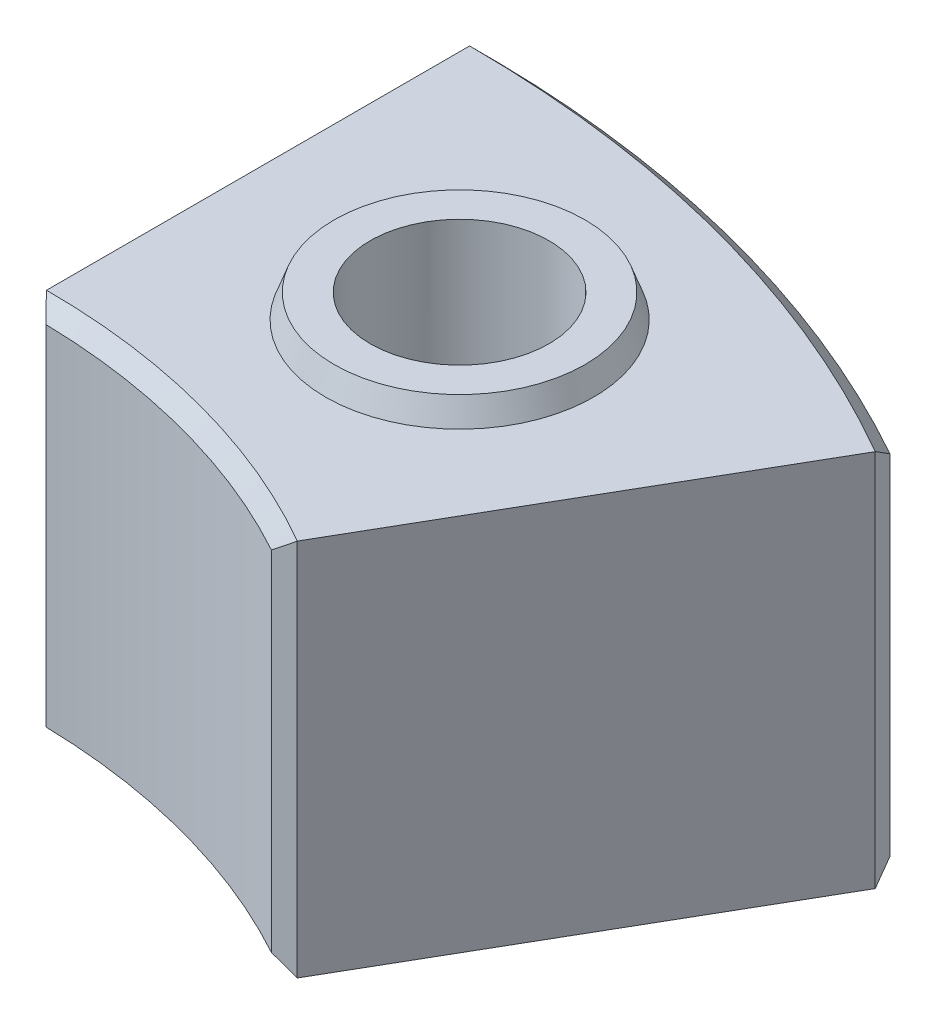
ISO-10303-21;
HEADER;
FILE_DESCRIPTION(('STEP AP214'),'2;1');
FILE_NAME('part.step','',(''),(''),'','','');
FILE_SCHEMA(('AUTOMOTIVE_DESIGN { 1 0 10303 214 1 1 1 1 }'));
ENDSEC;
DATA;
#1=APPLICATION_CONTEXT('core data for automotive mechanical design processes');
#2=APPLICATION_PROTOCOL_DEFINITION('international standard','automotive_design',2000,#1);
#3=PRODUCT_CONTEXT('',#1,'mechanical');
#4=PRODUCT('Part','Part','',(#3));
#5=PRODUCT_RELATED_PRODUCT_CATEGORY('part','',(#4));
#6=PRODUCT_DEFINITION_FORMATION('','',#4);
#7=PRODUCT_DEFINITION_CONTEXT('part definition',#1,'design');
#8=PRODUCT_DEFINITION('design','',#6,#7);
#9=PRODUCT_DEFINITION_SHAPE('','',#8);
#10=(LENGTH_UNIT() NAMED_UNIT(*) SI_UNIT(.MILLI.,.METRE.));
#11=(NAMED_UNIT(*) PLANE_ANGLE_UNIT() SI_UNIT($,.RADIAN.));
#12=(NAMED_UNIT(*) SI_UNIT($,.STERADIAN.) SOLID_ANGLE_UNIT());
#13=UNCERTAINTY_MEASURE_WITH_UNIT(LENGTH_MEASURE(1.E-05),#10,'distance_accuracy_value','');
#14=(GEOMETRIC_REPRESENTATION_CONTEXT(3) GLOBAL_UNCERTAINTY_ASSIGNED_CONTEXT((#13)) GLOBAL_UNIT_ASSIGNED_CONTEXT((#10,
#11,#12)) REPRESENTATION_CONTEXT('',''));
#15=CARTESIAN_POINT('',(0.,0.,0.));
#16=DIRECTION('',(0.,0.,1.));
#17=DIRECTION('',(1.,0.,0.));
#18=AXIS2_PLACEMENT_3D('',#15,#16,#17);
#19=CARTESIAN_POINT('',(77.904532575859,-127.,-290.74367371301));
#20=DIRECTION('',(0.,1.,0.));
#21=DIRECTION('',(0.,0.,1.));
#22=AXIS2_PLACEMENT_3D('',#19,#20,#21);
#23=CYLINDRICAL_SURFACE('',#22,30.);
#24=CARTESIAN_POINT('',(77.904532575859,8.,-290.74367371301));
#25=DIRECTION('',(0.,1.,0.));
#26=DIRECTION('',(0.,0.,1.));
#27=AXIS2_PLACEMENT_3D('',#24,#25,#26);
#28=CIRCLE('',#27,30.);
#29=CARTESIAN_POINT('',(77.904532575859,8.,-260.74367371301));
#30=VERTEX_POINT('',#29);
#31=EDGE_CURVE('E373',#30,#30,#28,.T.);
#32=ORIENTED_EDGE('',*,*,#31,.T.);
#33=EDGE_LOOP('',(#32));
#34=FACE_BOUND('',#33,.T.);
#35=CARTESIAN_POINT('',(77.904532575859,-117.,-290.74367371301));
#36=DIRECTION('',(0.,-1.,0.));
#37=DIRECTION('',(0.,0.,-1.));
#38=AXIS2_PLACEMENT_3D('',#35,#36,#37);
#39=CIRCLE('',#38,30.);
#40=CARTESIAN_POINT('',(77.904532575859,-117.,-320.74367371301));
#41=VERTEX_POINT('',#40);
#42=EDGE_CURVE('E239',#41,#41,#39,.T.);
#43=ORIENTED_EDGE('',*,*,#42,.T.);
#44=EDGE_LOOP('',(#43));
#45=FACE_BOUND('',#44,.T.);
#46=ADVANCED_FACE('F35',(#34,#45),#23,.F.);
#47=CARTESIAN_POINT('',(0.,0.,0.));
#48=DIRECTION('',(0.,1.,0.));
#49=DIRECTION('',(0.,0.,1.));
#50=AXIS2_PLACEMENT_3D('',#47,#48,#49);
#51=PLANE('',#50);
#52=DIRECTION('',(0.,0.,1.));
#53=VECTOR('',#52,1.);
#54=CARTESIAN_POINT('',(0.,0.,-225.));
#55=LINE('',#54,#53);
#56=CARTESIAN_POINT('',(0.,0.,-371.966396331712));
#57=VERTEX_POINT('',#56);
#58=CARTESIAN_POINT('',(0.,0.,-230.));
#59=VERTEX_POINT('',#58);
#60=EDGE_CURVE('E361',#57,#59,#55,.T.);
#61=ORIENTED_EDGE('',*,*,#60,.T.);
#62=CARTESIAN_POINT('',(0.,0.,0.));
#63=DIRECTION('',(0.,1.,0.));
#64=DIRECTION('',(0.,0.,1.));
#65=AXIS2_PLACEMENT_3D('',#62,#63,#64);
#66=CIRCLE('',#65,230.);
#67=CARTESIAN_POINT('',(115.,0.,-199.185842870421));
#68=VERTEX_POINT('',#67);
#69=EDGE_CURVE('E191',#59,#68,#66,.F.);
#70=ORIENTED_EDGE('',*,*,#69,.T.);
#71=DIRECTION('',(0.500000000000001,0.,-0.866025403784438));
#72=VECTOR('',#71,1.);
#73=CARTESIAN_POINT('',(112.5,0.,-194.855715851499));
#74=LINE('',#73,#72);
#75=CARTESIAN_POINT('',(185.983198165856,0.,-322.132348577413));
#76=VERTEX_POINT('',#75);
#77=EDGE_CURVE('E355',#68,#76,#74,.T.);
#78=ORIENTED_EDGE('',*,*,#77,.T.);
#79=DIRECTION('',(0.265304783703887,0.,0.964164597848227));
#80=VECTOR('',#79,1.);
#81=CARTESIAN_POINT('',(255.293110955295,0.,-70.2478432979643));
#82=LINE('',#81,#80);
#83=CARTESIAN_POINT('',(185.97050514315,0.,-322.178477271219));
#84=VERTEX_POINT('',#83);
#85=EDGE_CURVE('E187',#76,#84,#82,.F.);
#86=ORIENTED_EDGE('',*,*,#85,.T.);
#87=CARTESIAN_POINT('',(0.,0.,0.));
#88=DIRECTION('',(0.,1.,0.));
#89=DIRECTION('',(0.,0.,1.));
#90=AXIS2_PLACEMENT_3D('',#87,#88,#89);
#91=CIRCLE('',#90,372.);
#92=CARTESIAN_POINT('',(0.0340568270174031,0.,-371.999998441038));
#93=VERTEX_POINT('',#92);
#94=EDGE_CURVE('E185',#84,#93,#91,.T.);
#95=ORIENTED_EDGE('',*,*,#94,.T.);
#96=DIRECTION('',(0.711842981357215,0.,-0.702338643314229));
#97=VECTOR('',#96,1.);
#98=CARTESIAN_POINT('',(-185.966397849462,0.,-188.482972334752));
#99=LINE('',#98,#97);
#100=EDGE_CURVE('E189',#93,#57,#99,.F.);
#101=ORIENTED_EDGE('',*,*,#100,.T.);
#102=EDGE_LOOP('',(#61,#70,#78,#86,#95,#101));
#103=FACE_BOUND('',#102,.T.);
#104=CARTESIAN_POINT('',(77.904532575859,0.,-290.74367371301));
#105=DIRECTION('',(0.,1.,0.));
#106=DIRECTION('',(0.,0.,1.));
#107=AXIS2_PLACEMENT_3D('',#104,#105,#106);
#108=CIRCLE('',#107,45.);
#109=CARTESIAN_POINT('',(77.904532575859,0.,-245.74367371301));
#110=VERTEX_POINT('',#109);
#111=EDGE_CURVE('E366',#110,#110,#108,.T.);
#112=ORIENTED_EDGE('',*,*,#111,.F.);
#113=EDGE_LOOP('',(#112));
#114=FACE_BOUND('',#113,.T.);
#115=ADVANCED_FACE('F283',(#103,#114),#51,.T.);
#116=CARTESIAN_POINT('',(0.,-127.,0.));
#117=DIRECTION('',(0.,1.,0.));
#118=DIRECTION('',(0.,0.,1.));
#119=AXIS2_PLACEMENT_3D('',#116,#117,#118);
#120=CYLINDRICAL_SURFACE('',#119,225.);
#121=CARTESIAN_POINT('',(0.,-122.,0.));
#122=DIRECTION('',(0.,1.,0.));
#123=DIRECTION('',(0.,0.,1.));
#124=AXIS2_PLACEMENT_3D('',#121,#122,#123);
#125=CIRCLE('',#124,225.);
#126=CARTESIAN_POINT('',(4.89130434782612,-122.,-224.94682736544));
#127=VERTEX_POINT('',#126);
#128=CARTESIAN_POINT('',(108.237419859861,-122.,-197.255319173096));
#129=VERTEX_POINT('',#128);
#130=EDGE_CURVE('E155',#127,#129,#125,.F.);
#131=ORIENTED_EDGE('',*,*,#130,.T.);
#132=DIRECTION('',(0.,1.,0.));
#133=VECTOR('',#132,1.);
#134=CARTESIAN_POINT('',(108.237419859861,-127.,-197.255319173096));
#135=LINE('',#134,#133);
#136=CARTESIAN_POINT('',(108.237419859861,-5.00000000000003,-197.255319173096));
#137=VERTEX_POINT('',#136);
#138=EDGE_CURVE('E135',#129,#137,#135,.T.);
#139=ORIENTED_EDGE('',*,*,#138,.T.);
#140=CARTESIAN_POINT('',(0.,-5.00000000000003,0.));
#141=DIRECTION('',(0.,1.,0.));
#142=DIRECTION('',(0.,0.,1.));
#143=AXIS2_PLACEMENT_3D('',#140,#141,#142);
#144=CIRCLE('',#143,225.);
#145=CARTESIAN_POINT('',(4.89130434782612,-5.00000000000003,-224.94682736544));
#146=VERTEX_POINT('',#145);
#147=EDGE_CURVE('E143',#137,#146,#144,.T.);
#148=ORIENTED_EDGE('',*,*,#147,.T.);
#149=DIRECTION('',(0.,1.,0.));
#150=VECTOR('',#149,1.);
#151=CARTESIAN_POINT('',(4.89130434782612,-127.,-224.94682736544));
#152=LINE('',#151,#150);
#153=EDGE_CURVE('E150',#146,#127,#152,.F.);
#154=ORIENTED_EDGE('',*,*,#153,.T.);
#155=EDGE_LOOP('',(#131,#139,#148,#154));
#156=FACE_BOUND('',#155,.T.);
#157=ADVANCED_FACE('F153',(#156),#120,.F.);
#158=CARTESIAN_POINT('',(0.,-127.,-225.));
#159=DIRECTION('',(-1.,0.,0.));
#160=DIRECTION('',(0.,0.,1.));
#161=AXIS2_PLACEMENT_3D('',#158,#159,#160);
#162=PLANE('',#161);
#163=DIRECTION('',(0.,0.,1.));
#164=VECTOR('',#163,1.);
#165=CARTESIAN_POINT('',(0.,-127.,-225.));
#166=LINE('',#165,#164);
#167=CARTESIAN_POINT('',(0.,-127.,-371.966396331712));
#168=VERTEX_POINT('',#167);
#169=CARTESIAN_POINT('',(0.,-127.,-230.));
#170=VERTEX_POINT('',#169);
#171=EDGE_CURVE('E343',#168,#170,#166,.T.);
#172=ORIENTED_EDGE('',*,*,#171,.T.);
#173=DIRECTION('',(0.,-0.707106781186549,-0.707106781186546));
#174=VECTOR('',#173,1.);
#175=CARTESIAN_POINT('',(0.,103.000000000001,0.));
#176=LINE('',#175,#174);
#177=CARTESIAN_POINT('',(0.,-126.945645751338,-229.945645751338));
#178=VERTEX_POINT('',#177);
#179=EDGE_CURVE('E183',#170,#178,#176,.F.);
#180=ORIENTED_EDGE('',*,*,#179,.T.);
#181=DIRECTION('',(0.,1.,0.));
#182=VECTOR('',#181,1.);
#183=CARTESIAN_POINT('',(0.,-127.,-229.945645751338));
#184=LINE('',#183,#182);
#185=CARTESIAN_POINT('',(0.,-0.0543542486616255,-229.945645751338));
#186=VERTEX_POINT('',#185);
#187=EDGE_CURVE('E181',#178,#186,#184,.T.);
#188=ORIENTED_EDGE('',*,*,#187,.T.);
#189=DIRECTION('',(0.,-0.707106781186549,0.707106781186546));
#190=VECTOR('',#189,1.);
#191=CARTESIAN_POINT('',(0.,-230.000000000001,0.));
#192=LINE('',#191,#190);
#193=EDGE_CURVE('E179',#186,#59,#192,.F.);
#194=ORIENTED_EDGE('',*,*,#193,.T.);
#195=ORIENTED_EDGE('',*,*,#60,.F.);
#196=DIRECTION('',(0.,-1.,0.));
#197=VECTOR('',#196,1.);
#198=CARTESIAN_POINT('',(0.,-127.,-371.966396331712));
#199=LINE('',#198,#197);
#200=EDGE_CURVE('E176',#57,#168,#199,.T.);
#201=ORIENTED_EDGE('',*,*,#200,.T.);
#202=EDGE_LOOP('',(#172,#180,#188,#194,#195,#201));
#203=FACE_BOUND('',#202,.T.);
#204=ADVANCED_FACE('F303',(#203),#162,.T.);
#205=CARTESIAN_POINT('',(0.,-127.,0.));
#206=DIRECTION('',(0.,1.,0.));
#207=DIRECTION('',(0.,0.,1.));
#208=AXIS2_PLACEMENT_3D('',#205,#206,#207);
#209=CYLINDRICAL_SURFACE('',#208,377.);
#210=CARTESIAN_POINT('',(0.,-122.,0.));
#211=DIRECTION('',(0.,1.,0.));
#212=DIRECTION('',(0.,0.,1.));
#213=AXIS2_PLACEMENT_3D('',#210,#211,#212);
#214=CIRCLE('',#213,377.);
#215=CARTESIAN_POINT('',(184.094644683855,-122.,-328.995686595927));
#216=VERTEX_POINT('',#215);
#217=CARTESIAN_POINT('',(5.06720430107527,-122.,-376.965944669504));
#218=VERTEX_POINT('',#217);
#219=EDGE_CURVE('E50',#216,#218,#214,.T.);
#220=ORIENTED_EDGE('',*,*,#219,.T.);
#221=DIRECTION('',(0.,1.,0.));
#222=VECTOR('',#221,1.);
#223=CARTESIAN_POINT('',(5.06720430107527,-127.,-376.965944669504));
#224=LINE('',#223,#222);
#225=CARTESIAN_POINT('',(5.06720430107527,-5.,-376.965944669504));
#226=VERTEX_POINT('',#225);
#227=EDGE_CURVE('E11',#218,#226,#224,.T.);
#228=ORIENTED_EDGE('',*,*,#227,.T.);
#229=CARTESIAN_POINT('',(0.,-5.,0.));
#230=DIRECTION('',(0.,1.,0.));
#231=DIRECTION('',(0.,0.,1.));
#232=AXIS2_PLACEMENT_3D('',#229,#230,#231);
#233=CIRCLE('',#232,377.);
#234=CARTESIAN_POINT('',(184.094644683855,-5.,-328.995686595927));
#235=VERTEX_POINT('',#234);
#236=EDGE_CURVE('E193',#226,#235,#233,.F.);
#237=ORIENTED_EDGE('',*,*,#236,.T.);
#238=DIRECTION('',(0.,1.,0.));
#239=VECTOR('',#238,1.);
#240=CARTESIAN_POINT('',(184.094644683855,-127.,-328.995686595927));
#241=LINE('',#240,#239);
#242=EDGE_CURVE('E61',#235,#216,#241,.F.);
#243=ORIENTED_EDGE('',*,*,#242,.T.);
#244=EDGE_LOOP('',(#220,#228,#237,#243));
#245=FACE_BOUND('',#244,.T.);
#246=ADVANCED_FACE('F306',(#245),#209,.T.);
#247=CARTESIAN_POINT('',(112.5,-127.,-194.855715851499));
#248=DIRECTION('',(0.866025403784438,0.,0.500000000000001));
#249=DIRECTION('',(0.500000000000001,0.,-0.866025403784438));
#250=AXIS2_PLACEMENT_3D('',#247,#248,#249);
#251=PLANE('',#250);
#252=DIRECTION('',(0.,-1.,0.));
#253=VECTOR('',#252,1.);
#254=CARTESIAN_POINT('',(114.972822875669,-127.,-199.138770710276));
#255=LINE('',#254,#253);
#256=CARTESIAN_POINT('',(114.972822875669,-0.0543542486616255,-199.138770710276));
#257=VERTEX_POINT('',#256);
#258=CARTESIAN_POINT('',(114.972822875669,-126.945645751338,-199.138770710276));
#259=VERTEX_POINT('',#258);
#260=EDGE_CURVE('E137',#257,#259,#255,.T.);
#261=ORIENTED_EDGE('',*,*,#260,.T.);
#262=DIRECTION('',(-0.353553390593274,0.70710678118655,0.612372435695792));
#263=VECTOR('',#262,1.);
#264=CARTESIAN_POINT('',(0.,103.000000000001,0.));
#265=LINE('',#264,#263);
#266=CARTESIAN_POINT('',(115.,-127.,-199.185842870421));
#267=VERTEX_POINT('',#266);
#268=EDGE_CURVE('E166',#259,#267,#265,.F.);
#269=ORIENTED_EDGE('',*,*,#268,.T.);
#270=DIRECTION('',(0.500000000000001,0.,-0.866025403784438));
#271=VECTOR('',#270,1.);
#272=CARTESIAN_POINT('',(112.5,-127.,-194.855715851499));
#273=LINE('',#272,#271);
#274=CARTESIAN_POINT('',(185.983198165856,-127.,-322.132348577413));
#275=VERTEX_POINT('',#274);
#276=EDGE_CURVE('E364',#267,#275,#273,.T.);
#277=ORIENTED_EDGE('',*,*,#276,.T.);
#278=DIRECTION('',(0.,1.,0.));
#279=VECTOR('',#278,1.);
#280=CARTESIAN_POINT('',(185.983198165856,-127.,-322.132348577413));
#281=LINE('',#280,#279);
#282=EDGE_CURVE('E157',#275,#76,#281,.T.);
#283=ORIENTED_EDGE('',*,*,#282,.T.);
#284=ORIENTED_EDGE('',*,*,#77,.F.);
#285=DIRECTION('',(0.353553390593274,0.70710678118655,-0.612372435695792));
#286=VECTOR('',#285,1.);
#287=CARTESIAN_POINT('',(0.,-230.000000000001,0.));
#288=LINE('',#287,#286);
#289=EDGE_CURVE('E159',#68,#257,#288,.F.);
#290=ORIENTED_EDGE('',*,*,#289,.T.);
#291=EDGE_LOOP('',(#261,#269,#277,#283,#284,#290));
#292=FACE_BOUND('',#291,.T.);
#293=ADVANCED_FACE('F300',(#292),#251,.T.);
#294=CARTESIAN_POINT('',(0.,-127.,0.));
#295=DIRECTION('',(0.,1.,0.));
#296=DIRECTION('',(0.,0.,1.));
#297=AXIS2_PLACEMENT_3D('',#294,#295,#296);
#298=PLANE('',#297);
#299=CARTESIAN_POINT('',(77.904532575859,-127.,-290.74367371301));
#300=DIRECTION('',(0.,-1.,0.));
#301=DIRECTION('',(0.,0.,-1.));
#302=AXIS2_PLACEMENT_3D('',#299,#300,#301);
#303=CIRCLE('',#302,46.);
#304=CARTESIAN_POINT('',(77.904532575859,-127.,-336.74367371301));
#305=VERTEX_POINT('',#304);
#306=EDGE_CURVE('E337',#305,#305,#303,.T.);
#307=ORIENTED_EDGE('',*,*,#306,.F.);
#308=EDGE_LOOP('',(#307));
#309=FACE_BOUND('',#308,.T.);
#310=ORIENTED_EDGE('',*,*,#276,.F.);
#311=CARTESIAN_POINT('',(0.,-127.,0.));
#312=DIRECTION('',(0.,1.,0.));
#313=DIRECTION('',(0.,0.,1.));
#314=AXIS2_PLACEMENT_3D('',#311,#312,#313);
#315=CIRCLE('',#314,230.);
#316=EDGE_CURVE('E174',#267,#170,#315,.T.);
#317=ORIENTED_EDGE('',*,*,#316,.T.);
#318=ORIENTED_EDGE('',*,*,#171,.F.);
#319=DIRECTION('',(-0.711842981357215,0.,0.702338643314229));
#320=VECTOR('',#319,1.);
#321=CARTESIAN_POINT('',(5.06720430107527,-127.,-376.965944669504));
#322=LINE('',#321,#320);
#323=CARTESIAN_POINT('',(0.0340568270174031,-127.,-371.999998441038));
#324=VERTEX_POINT('',#323);
#325=EDGE_CURVE('E172',#168,#324,#322,.F.);
#326=ORIENTED_EDGE('',*,*,#325,.T.);
#327=CARTESIAN_POINT('',(0.,-127.,0.));
#328=DIRECTION('',(0.,1.,0.));
#329=DIRECTION('',(0.,0.,1.));
#330=AXIS2_PLACEMENT_3D('',#327,#328,#329);
#331=CIRCLE('',#330,372.);
#332=CARTESIAN_POINT('',(185.97050514315,-127.,-322.178477271219));
#333=VERTEX_POINT('',#332);
#334=EDGE_CURVE('E170',#324,#333,#331,.F.);
#335=ORIENTED_EDGE('',*,*,#334,.T.);
#336=DIRECTION('',(-0.265304783703887,0.,-0.964164597848227));
#337=VECTOR('',#336,1.);
#338=CARTESIAN_POINT('',(185.983198165856,-127.,-322.132348577413));
#339=LINE('',#338,#337);
#340=EDGE_CURVE('E168',#333,#275,#339,.F.);
#341=ORIENTED_EDGE('',*,*,#340,.T.);
#342=EDGE_LOOP('',(#310,#317,#318,#326,#335,#341));
#343=FACE_BOUND('',#342,.T.);
#344=ADVANCED_FACE('F298',(#309,#343),#298,.F.);
#345=CARTESIAN_POINT('',(77.904532575859,8.,-290.74367371301));
#346=DIRECTION('',(0.,1.,0.));
#347=DIRECTION('',(0.,0.,1.));
#348=AXIS2_PLACEMENT_3D('',#345,#346,#347);
#349=PLANE('',#348);
#350=CARTESIAN_POINT('',(77.904532575859,8.,-290.74367371301));
#351=DIRECTION('',(0.,1.,0.));
#352=DIRECTION('',(0.,0.,1.));
#353=AXIS2_PLACEMENT_3D('',#350,#351,#352);
#354=CIRCLE('',#353,42.0882381258703);
#355=CARTESIAN_POINT('',(77.904532575859,8.,-248.655435587139));
#356=VERTEX_POINT('',#355);
#357=EDGE_CURVE('E340',#356,#356,#354,.T.);
#358=ORIENTED_EDGE('',*,*,#357,.T.);
#359=EDGE_LOOP('',(#358));
#360=FACE_BOUND('',#359,.T.);
#361=ORIENTED_EDGE('',*,*,#31,.F.);
#362=EDGE_LOOP('',(#361));
#363=FACE_BOUND('',#362,.T.);
#364=ADVANCED_FACE('F296',(#360,#363),#349,.T.);
#365=CARTESIAN_POINT('',(77.904532575859,8.,-290.74367371301));
#366=DIRECTION('',(0.,-1.,0.));
#367=DIRECTION('',(0.,0.,-1.));
#368=AXIS2_PLACEMENT_3D('',#365,#366,#367);
#369=CONICAL_SURFACE('',#368,42.0882381258703,0.34906585039887);
#370=ORIENTED_EDGE('',*,*,#111,.T.);
#371=EDGE_LOOP('',(#370));
#372=FACE_BOUND('',#371,.T.);
#373=ORIENTED_EDGE('',*,*,#357,.F.);
#374=EDGE_LOOP('',(#373));
#375=FACE_BOUND('',#374,.T.);
#376=ADVANCED_FACE('F316',(#372,#375),#369,.T.);
#377=CARTESIAN_POINT('',(77.904532575859,-117.,-290.74367371301));
#378=DIRECTION('',(0.,-1.,0.));
#379=DIRECTION('',(0.,0.,-1.));
#380=AXIS2_PLACEMENT_3D('',#377,#378,#379);
#381=PLANE('',#380);
#382=CARTESIAN_POINT('',(77.904532575859,-117.,-290.74367371301));
#383=DIRECTION('',(0.,-1.,0.));
#384=DIRECTION('',(0.,0.,-1.));
#385=AXIS2_PLACEMENT_3D('',#382,#383,#384);
#386=CIRCLE('',#385,42.360297657338);
#387=CARTESIAN_POINT('',(77.904532575859,-117.,-333.103971370348));
#388=VERTEX_POINT('',#387);
#389=EDGE_CURVE('E151',#388,#388,#386,.T.);
#390=ORIENTED_EDGE('',*,*,#389,.T.);
#391=EDGE_LOOP('',(#390));
#392=FACE_BOUND('',#391,.T.);
#393=ORIENTED_EDGE('',*,*,#42,.F.);
#394=EDGE_LOOP('',(#393));
#395=FACE_BOUND('',#394,.T.);
#396=ADVANCED_FACE('F321',(#392,#395),#381,.T.);
#397=CARTESIAN_POINT('',(77.904532575859,-117.,-290.74367371301));
#398=DIRECTION('',(0.,-1.,0.));
#399=DIRECTION('',(0.,0.,-1.));
#400=AXIS2_PLACEMENT_3D('',#397,#398,#399);
#401=CONICAL_SURFACE('',#400,42.360297657338,0.34906585039887);
#402=ORIENTED_EDGE('',*,*,#306,.T.);
#403=EDGE_LOOP('',(#402));
#404=FACE_BOUND('',#403,.T.);
#405=ORIENTED_EDGE('',*,*,#389,.F.);
#406=EDGE_LOOP('',(#405));
#407=FACE_BOUND('',#406,.T.);
#408=ADVANCED_FACE('F323',(#404,#407),#401,.F.);
#409=CARTESIAN_POINT('',(0.,-127.,-229.945645751338));
#410=DIRECTION('',(0.714751400990154,0.,-0.699378606180238));
#411=DIRECTION('',(0.,1.,0.));
#412=AXIS2_PLACEMENT_3D('',#409,#410,#411);
#413=PLANE('',#412);
#414=CARTESIAN_POINT('',(0.,-0.0543542486616258,-229.945645751338));
#415=CARTESIAN_POINT('',(0.406150929451824,-0.469432427677621,-229.530567361359));
#416=CARTESIAN_POINT('',(0.812657802164443,-0.883798724259161,-229.115125204256));
#417=CARTESIAN_POINT('',(1.62639395009487,-1.71107045778135,-228.283502608669));
#418=CARTESIAN_POINT('',(2.03362322055407,-2.12397590429173,-227.867322175049));
#419=CARTESIAN_POINT('',(2.8488200979617,-2.94829438030328,-227.034206742204));
#420=CARTESIAN_POINT('',(3.25678770506814,-3.35970740948501,-226.617271742819));
#421=CARTESIAN_POINT('',(4.07347742031988,-4.18100770445114,-225.782630658587));
#422=CARTESIAN_POINT('',(4.48219953339943,-4.59089496020416,-225.364924568699));
#423=CARTESIAN_POINT('',(4.89130434782613,-5.00000000000002,-224.94682736544));
#424=B_SPLINE_CURVE_WITH_KNOTS('',3,(#414,#415,#416,#417,#418,#419,#420,#421,#422,#423),
.UNSPECIFIED.,.F.,.F.,(4,2,2,2,4),(0.,2.14145866173035,4.28290326913835,6.42434833486957,
8.56580745499184),.UNSPECIFIED.);
#425=EDGE_CURVE('E147',#186,#146,#424,.T.);
#426=ORIENTED_EDGE('',*,*,#425,.F.);
#427=ORIENTED_EDGE('',*,*,#187,.F.);
#428=CARTESIAN_POINT('',(0.,-126.945645751338,-229.945645751338));
#429=CARTESIAN_POINT('',(0.406150929451823,-126.530567572322,-229.530567361359));
#430=CARTESIAN_POINT('',(0.812657802164444,-126.116201275741,-229.115125204256));
#431=CARTESIAN_POINT('',(1.62639395009488,-125.288929542219,-228.283502608669));
#432=CARTESIAN_POINT('',(2.03362322055407,-124.876024095708,-227.867322175049));
#433=CARTESIAN_POINT('',(2.8488200979617,-124.051705619697,-227.034206742204));
#434=CARTESIAN_POINT('',(3.25678770506814,-123.640292590515,-226.617271742819));
#435=CARTESIAN_POINT('',(4.07347742031988,-122.818992295549,-225.782630658587));
#436=CARTESIAN_POINT('',(4.48219953339943,-122.409105039796,-225.364924568699));
#437=CARTESIAN_POINT('',(4.89130434782613,-122.,-224.94682736544));
#438=B_SPLINE_CURVE_WITH_KNOTS('',3,(#428,#429,#430,#431,#432,#433,#434,#435,#436,#437),
.UNSPECIFIED.,.F.,.F.,(4,2,2,2,4),(0.,2.14145866173036,4.28290326913836,6.42434833486956,
8.56580745499184),.UNSPECIFIED.);
#439=EDGE_CURVE('E232',#127,#178,#438,.F.);
#440=ORIENTED_EDGE('',*,*,#439,.F.);
#441=ORIENTED_EDGE('',*,*,#153,.F.);
#442=EDGE_LOOP('',(#426,#427,#440,#441));
#443=FACE_BOUND('',#442,.T.);
#444=ADVANCED_FACE('F226',(#443),#413,.F.);
#445=CARTESIAN_POINT('',(0.,-122.,0.));
#446=DIRECTION('',(0.,-1.,0.));
#447=DIRECTION('',(0.,0.,-1.));
#448=AXIS2_PLACEMENT_3D('',#445,#446,#447);
#449=CONICAL_SURFACE('',#448,225.,0.785398163397446);
#450=ORIENTED_EDGE('',*,*,#316,.F.);
#451=ORIENTED_EDGE('',*,*,#268,.F.);
#452=CARTESIAN_POINT('',(114.972822875669,-126.945645751338,-199.138770710276));
#453=CARTESIAN_POINT('',(114.413546658004,-126.530567572322,-198.982377744718));
#454=CARTESIAN_POINT('',(113.85378030087,-126.116201275741,-198.82584771922));
#455=CARTESIAN_POINT('',(112.733252826991,-125.288929542219,-198.512509499046));
#456=CARTESIAN_POINT('',(112.172491716799,-124.876024095708,-198.355701306202));
#457=CARTESIAN_POINT('',(111.049952795456,-124.051705619697,-198.041800615778));
#458=CARTESIAN_POINT('',(110.488174984088,-123.640292590515,-197.884708118136));
#459=CARTESIAN_POINT('',(109.363580401555,-122.818992295549,-197.570232593776));
#460=CARTESIAN_POINT('',(108.800763623595,-122.409105039796,-197.412849565157));
#461=CARTESIAN_POINT('',(108.237419859861,-122.,-197.255319173096));
#462=B_SPLINE_CURVE_WITH_KNOTS('',3,(#452,#453,#454,#455,#456,#457,#458,#459,#460,#461),
.UNSPECIFIED.,.F.,.F.,(4,2,2,2,4),(0.,2.14145866173034,4.28290326913832,6.42434833486952,
8.56580745499181),.UNSPECIFIED.);
#463=EDGE_CURVE('E140',#129,#259,#462,.F.);
#464=ORIENTED_EDGE('',*,*,#463,.F.);
#465=ORIENTED_EDGE('',*,*,#130,.F.);
#466=ORIENTED_EDGE('',*,*,#439,.T.);
#467=ORIENTED_EDGE('',*,*,#179,.F.);
#468=EDGE_LOOP('',(#450,#451,#464,#465,#466,#467));
#469=FACE_BOUND('',#468,.T.);
#470=ADVANCED_FACE('F218',(#469),#449,.F.);
#471=CARTESIAN_POINT('',(0.,0.,0.));
#472=DIRECTION('',(0.,1.,0.));
#473=DIRECTION('',(0.,0.,1.));
#474=AXIS2_PLACEMENT_3D('',#471,#472,#473);
#475=CONICAL_SURFACE('',#474,230.,0.785398163397446);
#476=ORIENTED_EDGE('',*,*,#425,.T.);
#477=ORIENTED_EDGE('',*,*,#147,.F.);
#478=CARTESIAN_POINT('',(108.237419859861,-5.00000000000003,-197.255319173096));
#479=CARTESIAN_POINT('',(108.800763623595,-4.59089496020414,-197.412849565157));
#480=CARTESIAN_POINT('',(109.363580401555,-4.18100770445112,-197.570232593776));
#481=CARTESIAN_POINT('',(110.488174984088,-3.359707409485,-197.884708118136));
#482=CARTESIAN_POINT('',(111.049952795456,-2.94829438030327,-198.041800615778));
#483=CARTESIAN_POINT('',(112.172491716799,-2.12397590429172,-198.355701306202));
#484=CARTESIAN_POINT('',(112.733252826991,-1.71107045778134,-198.512509499046));
#485=CARTESIAN_POINT('',(113.85378030087,-0.883798724259143,-198.82584771922));
#486=CARTESIAN_POINT('',(114.413546658004,-0.469432427677606,-198.982377744718));
#487=CARTESIAN_POINT('',(114.972822875669,-0.0543542486616327,-199.138770710276));
#488=B_SPLINE_CURVE_WITH_KNOTS('',3,(#478,#479,#480,#481,#482,#483,#484,#485,#486,#487),
.UNSPECIFIED.,.F.,.F.,(4,2,2,2,4),(0.,2.14145912012228,4.28290418585348,6.42434879326147,
8.56580745499181),.UNSPECIFIED.);
#489=EDGE_CURVE('E131',#257,#137,#488,.F.);
#490=ORIENTED_EDGE('',*,*,#489,.F.);
#491=ORIENTED_EDGE('',*,*,#289,.F.);
#492=ORIENTED_EDGE('',*,*,#69,.F.);
#493=ORIENTED_EDGE('',*,*,#193,.F.);
#494=EDGE_LOOP('',(#476,#477,#490,#491,#492,#493));
#495=FACE_BOUND('',#494,.T.);
#496=ADVANCED_FACE('F144',(#495),#475,.F.);
#497=CARTESIAN_POINT('',(108.237419859861,-127.,-197.255319173096));
#498=DIRECTION('',(-0.269303567557872,0.,-0.963055340310515));
#499=DIRECTION('',(0.,1.,0.));
#500=AXIS2_PLACEMENT_3D('',#497,#498,#499);
#501=PLANE('',#500);
#502=ORIENTED_EDGE('',*,*,#463,.T.);
#503=ORIENTED_EDGE('',*,*,#260,.F.);
#504=ORIENTED_EDGE('',*,*,#489,.T.);
#505=ORIENTED_EDGE('',*,*,#138,.F.);
#506=EDGE_LOOP('',(#502,#503,#504,#505));
#507=FACE_BOUND('',#506,.T.);
#508=ADVANCED_FACE('F133',(#507),#501,.F.);
#509=CARTESIAN_POINT('',(185.983198165856,-127.,-322.132348577413));
#510=DIRECTION('',(-0.964164597848227,0.,0.265304783703887));
#511=DIRECTION('',(0.,1.,0.));
#512=AXIS2_PLACEMENT_3D('',#509,#510,#511);
#513=PLANE('',#512);
#514=ORIENTED_EDGE('',*,*,#282,.F.);
#515=ORIENTED_EDGE('',*,*,#340,.F.);
#516=CARTESIAN_POINT('',(185.97050514315,-127.,-322.178477271219));
#517=CARTESIAN_POINT('',(185.657166161898,-126.170374133067,-323.317206654955));
#518=CARTESIAN_POINT('',(185.344174963754,-125.338894526021,-324.454672133246));
#519=CARTESIAN_POINT('',(184.718888144012,-123.672227859232,-326.727075241398));
#520=CARTESIAN_POINT('',(184.406592522391,-122.837040799612,-327.862012871344));
#521=CARTESIAN_POINT('',(184.094644683855,-122.,-328.995686595927));
#522=B_SPLINE_CURVE_WITH_KNOTS('',3,(#516,#517,#518,#519,#520,#521),.UNSPECIFIED.,.F.,.F.,(4,2,
4),(0.,4.32993601248062,8.65987188190794),.UNSPECIFIED.);
#523=EDGE_CURVE('E41',#216,#333,#522,.F.);
#524=ORIENTED_EDGE('',*,*,#523,.F.);
#525=ORIENTED_EDGE('',*,*,#242,.F.);
#526=CARTESIAN_POINT('',(185.97050514315,0.,-322.178477271219));
#527=CARTESIAN_POINT('',(185.657166161898,-0.829625866932532,-323.317206654955));
#528=CARTESIAN_POINT('',(185.344174963754,-1.66110547397905,-324.454672133246));
#529=CARTESIAN_POINT('',(184.718888144012,-3.32777214076821,-326.727075241398));
#530=CARTESIAN_POINT('',(184.406592522391,-4.16295920038836,-327.862012871344));
#531=CARTESIAN_POINT('',(184.094644683855,-5.00000000000001,-328.995686595927));
#532=B_SPLINE_CURVE_WITH_KNOTS('',3,(#526,#527,#528,#529,#530,#531),.UNSPECIFIED.,.F.,.F.,(4,2,
4),(0.,4.32993601248062,8.65987188190794),.UNSPECIFIED.);
#533=EDGE_CURVE('E504',#84,#235,#532,.T.);
#534=ORIENTED_EDGE('',*,*,#533,.F.);
#535=ORIENTED_EDGE('',*,*,#85,.F.);
#536=EDGE_LOOP('',(#514,#515,#524,#525,#534,#535));
#537=FACE_BOUND('',#536,.T.);
#538=ADVANCED_FACE('F38',(#537),#513,.F.);
#539=CARTESIAN_POINT('',(0.,-122.,0.));
#540=DIRECTION('',(0.,1.,0.));
#541=DIRECTION('',(0.,0.,1.));
#542=AXIS2_PLACEMENT_3D('',#539,#540,#541);
#543=CONICAL_SURFACE('',#542,377.,0.785398163397448);
#544=ORIENTED_EDGE('',*,*,#523,.T.);
#545=ORIENTED_EDGE('',*,*,#334,.F.);
#546=CARTESIAN_POINT('',(0.0340568270174031,-127.,-371.999998441038));
#547=CARTESIAN_POINT('',(0.874781036646053,-126.170374133067,-372.829497524763));
#548=CARTESIAN_POINT('',(1.71457210454504,-125.338894526021,-373.658075925819));
#549=CARTESIAN_POINT('',(3.39228792916934,-123.672227859232,-375.313391335247));
#550=CARTESIAN_POINT('',(4.2302126859563,-122.837040799612,-376.140128343679));
#551=CARTESIAN_POINT('',(5.06720430107526,-122.,-376.965944669504));
#552=B_SPLINE_CURVE_WITH_KNOTS('',3,(#546,#547,#548,#549,#550,#551),.UNSPECIFIED.,.F.,.F.,(4,2,
4),(0.,4.32993601248059,8.6598718819079),.UNSPECIFIED.);
#553=EDGE_CURVE('E251',#218,#324,#552,.F.);
#554=ORIENTED_EDGE('',*,*,#553,.F.);
#555=ORIENTED_EDGE('',*,*,#219,.F.);
#556=EDGE_LOOP('',(#544,#545,#554,#555));
#557=FACE_BOUND('',#556,.T.);
#558=ADVANCED_FACE('F267',(#557),#543,.T.);
#559=CARTESIAN_POINT('',(0.,0.,0.));
#560=DIRECTION('',(0.,-1.,0.));
#561=DIRECTION('',(0.,0.,-1.));
#562=AXIS2_PLACEMENT_3D('',#559,#560,#561);
#563=CONICAL_SURFACE('',#562,372.,0.785398163397448);
#564=ORIENTED_EDGE('',*,*,#533,.T.);
#565=ORIENTED_EDGE('',*,*,#236,.F.);
#566=CARTESIAN_POINT('',(5.06720430107527,-5.,-376.965944669504));
#567=CARTESIAN_POINT('',(4.2302126859563,-4.16295920038836,-376.140128343679));
#568=CARTESIAN_POINT('',(3.39228792916934,-3.32777214076821,-375.313391335247));
#569=CARTESIAN_POINT('',(1.71457210454503,-1.66110547397907,-373.658075925819));
#570=CARTESIAN_POINT('',(0.874781036646043,-0.829625866932558,-372.829497524764));
#571=CARTESIAN_POINT('',(0.0340568270173914,0.,-371.999998441038));
#572=B_SPLINE_CURVE_WITH_KNOTS('',3,(#566,#567,#568,#569,#570,#571),.UNSPECIFIED.,.F.,.F.,(4,2,
4),(0.,4.32993586942728,8.65987188190789),.UNSPECIFIED.);
#573=EDGE_CURVE('E244',#93,#226,#572,.F.);
#574=ORIENTED_EDGE('',*,*,#573,.F.);
#575=ORIENTED_EDGE('',*,*,#94,.F.);
#576=EDGE_LOOP('',(#564,#565,#574,#575));
#577=FACE_BOUND('',#576,.T.);
#578=ADVANCED_FACE('F257',(#577),#563,.T.);
#579=CARTESIAN_POINT('',(5.06720430107527,-127.,-376.965944669504));
#580=DIRECTION('',(0.702338643314229,0.,0.711842981357215));
#581=DIRECTION('',(0.,1.,0.));
#582=AXIS2_PLACEMENT_3D('',#579,#580,#581);
#583=PLANE('',#582);
#584=ORIENTED_EDGE('',*,*,#325,.F.);
#585=ORIENTED_EDGE('',*,*,#200,.F.);
#586=ORIENTED_EDGE('',*,*,#100,.F.);
#587=ORIENTED_EDGE('',*,*,#573,.T.);
#588=ORIENTED_EDGE('',*,*,#227,.F.);
#589=ORIENTED_EDGE('',*,*,#553,.T.);
#590=EDGE_LOOP('',(#584,#585,#586,#587,#588,#589));
#591=FACE_BOUND('',#590,.T.);
#592=ADVANCED_FACE('F260',(#591),#583,.F.);
#593=CLOSED_SHELL('',(#46,#115,#157,#204,#246,#293,#344,#364,#376,#396,#408,#444,#470,#496,#508,
#538,#558,#578,#592));
#594=MANIFOLD_SOLID_BREP('B2',#593);
#595=ADVANCED_BREP_SHAPE_REPRESENTATION('',(#18,#594),#14);
#596=SHAPE_DEFINITION_REPRESENTATION(#9,#595);
ENDSEC;
END-ISO-10303-21;
